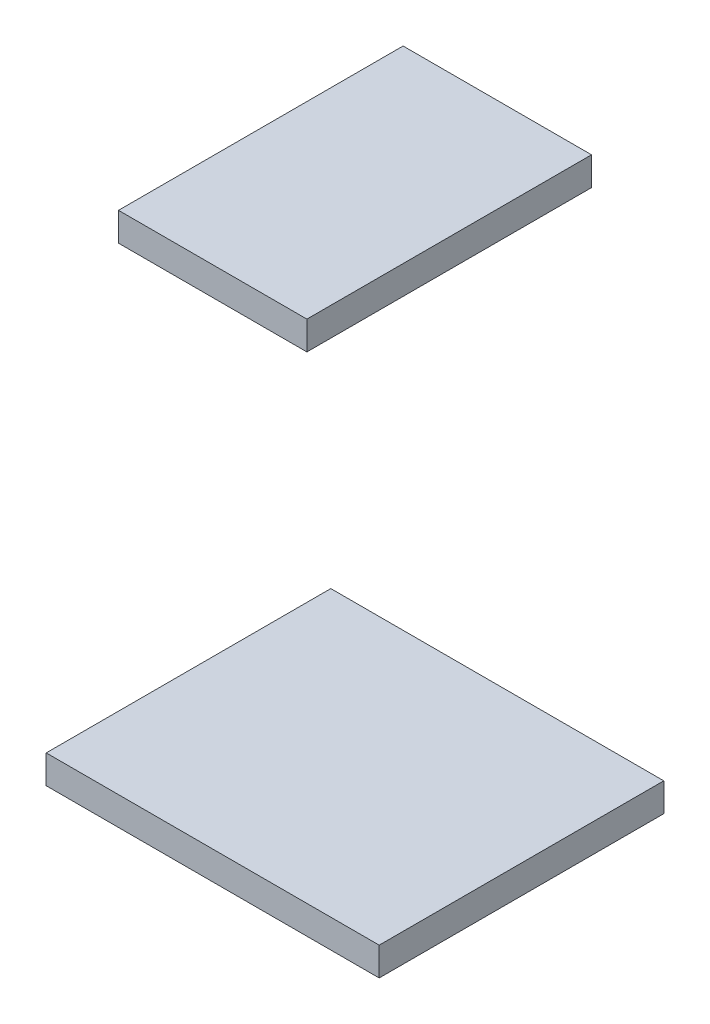
ISO-10303-21;
HEADER;
FILE_DESCRIPTION(('STEP AP214'),'2;1');
FILE_NAME('part.step','',(''),(''),'','','');
FILE_SCHEMA(('AUTOMOTIVE_DESIGN { 1 0 10303 214 1 1 1 1 }'));
ENDSEC;
DATA;
#1=APPLICATION_CONTEXT('core data for automotive mechanical design processes');
#2=APPLICATION_PROTOCOL_DEFINITION('international standard','automotive_design',2000,#1);
#3=PRODUCT_CONTEXT('',#1,'mechanical');
#4=PRODUCT('Part','Part','',(#3));
#5=PRODUCT_RELATED_PRODUCT_CATEGORY('part','',(#4));
#6=PRODUCT_DEFINITION_FORMATION('','',#4);
#7=PRODUCT_DEFINITION_CONTEXT('part definition',#1,'design');
#8=PRODUCT_DEFINITION('design','',#6,#7);
#9=PRODUCT_DEFINITION_SHAPE('','',#8);
#10=(LENGTH_UNIT() NAMED_UNIT(*) SI_UNIT(.MILLI.,.METRE.));
#11=(NAMED_UNIT(*) PLANE_ANGLE_UNIT() SI_UNIT($,.RADIAN.));
#12=(NAMED_UNIT(*) SI_UNIT($,.STERADIAN.) SOLID_ANGLE_UNIT());
#13=UNCERTAINTY_MEASURE_WITH_UNIT(LENGTH_MEASURE(1.E-05),#10,'distance_accuracy_value','');
#14=(GEOMETRIC_REPRESENTATION_CONTEXT(3) GLOBAL_UNCERTAINTY_ASSIGNED_CONTEXT((#13)) GLOBAL_UNIT_ASSIGNED_CONTEXT((#10,
#11,#12)) REPRESENTATION_CONTEXT('',''));
#15=CARTESIAN_POINT('',(0.,0.,0.));
#16=DIRECTION('',(0.,0.,1.));
#17=DIRECTION('',(1.,0.,0.));
#18=AXIS2_PLACEMENT_3D('',#15,#16,#17);
#19=CARTESIAN_POINT('',(99.655,-17.41,10.));
#20=DIRECTION('',(-1.,0.,0.));
#21=DIRECTION('',(0.,0.,1.));
#22=AXIS2_PLACEMENT_3D('',#19,#20,#21);
#23=PLANE('',#22);
#24=DIRECTION('',(0.,1.,0.));
#25=VECTOR('',#24,1.);
#26=CARTESIAN_POINT('',(99.655,-17.41,0.));
#27=LINE('',#26,#25);
#28=CARTESIAN_POINT('',(99.655,-18.41,0.));
#29=VERTEX_POINT('',#28);
#30=CARTESIAN_POINT('',(99.655,-17.41,0.));
#31=VERTEX_POINT('',#30);
#32=EDGE_CURVE('E12',#29,#31,#27,.T.);
#33=ORIENTED_EDGE('',*,*,#32,.T.);
#34=DIRECTION('',(0.,0.,-1.));
#35=VECTOR('',#34,1.);
#36=CARTESIAN_POINT('',(99.655,-17.41,10.));
#37=LINE('',#36,#35);
#38=CARTESIAN_POINT('',(99.655,-17.41,10.));
#39=VERTEX_POINT('',#38);
#40=EDGE_CURVE('E118',#39,#31,#37,.T.);
#41=ORIENTED_EDGE('',*,*,#40,.F.);
#42=DIRECTION('',(0.,1.,0.));
#43=VECTOR('',#42,1.);
#44=CARTESIAN_POINT('',(99.655,-17.41,10.));
#45=LINE('',#44,#43);
#46=CARTESIAN_POINT('',(99.655,-18.41,10.));
#47=VERTEX_POINT('',#46);
#48=EDGE_CURVE('E51',#47,#39,#45,.T.);
#49=ORIENTED_EDGE('',*,*,#48,.F.);
#50=DIRECTION('',(0.,0.,-1.));
#51=VECTOR('',#50,1.);
#52=CARTESIAN_POINT('',(99.655,-18.41,10.));
#53=LINE('',#52,#51);
#54=EDGE_CURVE('E106',#47,#29,#53,.T.);
#55=ORIENTED_EDGE('',*,*,#54,.T.);
#56=EDGE_LOOP('',(#33,#41,#49,#55));
#57=FACE_BOUND('',#56,.T.);
#58=ADVANCED_FACE('F47',(#57),#23,.F.);
#59=CARTESIAN_POINT('',(99.655,-17.41,10.));
#60=DIRECTION('',(0.,-1.,0.));
#61=DIRECTION('',(0.,0.,-1.));
#62=AXIS2_PLACEMENT_3D('',#59,#60,#61);
#63=PLANE('',#62);
#64=DIRECTION('',(-1.,0.,0.));
#65=VECTOR('',#64,1.);
#66=CARTESIAN_POINT('',(99.655,-17.41,0.));
#67=LINE('',#66,#65);
#68=CARTESIAN_POINT('',(93.035,-17.41,0.));
#69=VERTEX_POINT('',#68);
#70=EDGE_CURVE('E57',#31,#69,#67,.T.);
#71=ORIENTED_EDGE('',*,*,#70,.T.);
#72=DIRECTION('',(0.,0.,-1.));
#73=VECTOR('',#72,1.);
#74=CARTESIAN_POINT('',(93.035,-17.41,10.));
#75=LINE('',#74,#73);
#76=CARTESIAN_POINT('',(93.035,-17.41,10.));
#77=VERTEX_POINT('',#76);
#78=EDGE_CURVE('E102',#77,#69,#75,.T.);
#79=ORIENTED_EDGE('',*,*,#78,.F.);
#80=DIRECTION('',(-1.,0.,0.));
#81=VECTOR('',#80,1.);
#82=CARTESIAN_POINT('',(99.655,-17.41,10.));
#83=LINE('',#82,#81);
#84=EDGE_CURVE('E81',#39,#77,#83,.T.);
#85=ORIENTED_EDGE('',*,*,#84,.F.);
#86=ORIENTED_EDGE('',*,*,#40,.T.);
#87=EDGE_LOOP('',(#71,#79,#85,#86));
#88=FACE_BOUND('',#87,.T.);
#89=ADVANCED_FACE('F121',(#88),#63,.F.);
#90=CARTESIAN_POINT('',(93.035,-17.41,10.));
#91=DIRECTION('',(1.,0.,0.));
#92=DIRECTION('',(0.,0.,-1.));
#93=AXIS2_PLACEMENT_3D('',#90,#91,#92);
#94=PLANE('',#93);
#95=DIRECTION('',(0.,-1.,0.));
#96=VECTOR('',#95,1.);
#97=CARTESIAN_POINT('',(93.035,-17.41,0.));
#98=LINE('',#97,#96);
#99=CARTESIAN_POINT('',(93.035,-18.41,0.));
#100=VERTEX_POINT('',#99);
#101=EDGE_CURVE('E97',#69,#100,#98,.T.);
#102=ORIENTED_EDGE('',*,*,#101,.T.);
#103=DIRECTION('',(0.,0.,-1.));
#104=VECTOR('',#103,1.);
#105=CARTESIAN_POINT('',(93.035,-18.41,10.));
#106=LINE('',#105,#104);
#107=CARTESIAN_POINT('',(93.035,-18.41,10.));
#108=VERTEX_POINT('',#107);
#109=EDGE_CURVE('E100',#108,#100,#106,.T.);
#110=ORIENTED_EDGE('',*,*,#109,.F.);
#111=DIRECTION('',(0.,-1.,0.));
#112=VECTOR('',#111,1.);
#113=CARTESIAN_POINT('',(93.035,-17.41,10.));
#114=LINE('',#113,#112);
#115=EDGE_CURVE('E114',#77,#108,#114,.T.);
#116=ORIENTED_EDGE('',*,*,#115,.F.);
#117=ORIENTED_EDGE('',*,*,#78,.T.);
#118=EDGE_LOOP('',(#102,#110,#116,#117));
#119=FACE_BOUND('',#118,.T.);
#120=ADVANCED_FACE('F98',(#119),#94,.F.);
#121=CARTESIAN_POINT('',(99.655,-18.41,10.));
#122=DIRECTION('',(0.,1.,0.));
#123=DIRECTION('',(0.,0.,1.));
#124=AXIS2_PLACEMENT_3D('',#121,#122,#123);
#125=PLANE('',#124);
#126=DIRECTION('',(1.,0.,0.));
#127=VECTOR('',#126,1.);
#128=CARTESIAN_POINT('',(99.655,-18.41,0.));
#129=LINE('',#128,#127);
#130=EDGE_CURVE('E91',#100,#29,#129,.T.);
#131=ORIENTED_EDGE('',*,*,#130,.T.);
#132=ORIENTED_EDGE('',*,*,#54,.F.);
#133=DIRECTION('',(1.,0.,0.));
#134=VECTOR('',#133,1.);
#135=CARTESIAN_POINT('',(99.655,-18.41,10.));
#136=LINE('',#135,#134);
#137=EDGE_CURVE('E105',#108,#47,#136,.T.);
#138=ORIENTED_EDGE('',*,*,#137,.F.);
#139=ORIENTED_EDGE('',*,*,#109,.T.);
#140=EDGE_LOOP('',(#131,#132,#138,#139));
#141=FACE_BOUND('',#140,.T.);
#142=ADVANCED_FACE('F104',(#141),#125,.F.);
#143=CARTESIAN_POINT('',(0.,0.,10.));
#144=DIRECTION('',(0.,0.,-1.));
#145=DIRECTION('',(-1.,0.,0.));
#146=AXIS2_PLACEMENT_3D('',#143,#144,#145);
#147=PLANE('',#146);
#148=ORIENTED_EDGE('',*,*,#48,.T.);
#149=ORIENTED_EDGE('',*,*,#84,.T.);
#150=ORIENTED_EDGE('',*,*,#115,.T.);
#151=ORIENTED_EDGE('',*,*,#137,.T.);
#152=EDGE_LOOP('',(#148,#149,#150,#151));
#153=FACE_BOUND('',#152,.T.);
#154=ADVANCED_FACE('F49',(#153),#147,.F.);
#155=CARTESIAN_POINT('',(0.,0.,0.));
#156=DIRECTION('',(0.,0.,-1.));
#157=DIRECTION('',(-1.,0.,0.));
#158=AXIS2_PLACEMENT_3D('',#155,#156,#157);
#159=PLANE('',#158);
#160=ORIENTED_EDGE('',*,*,#32,.F.);
#161=ORIENTED_EDGE('',*,*,#130,.F.);
#162=ORIENTED_EDGE('',*,*,#101,.F.);
#163=ORIENTED_EDGE('',*,*,#70,.F.);
#164=EDGE_LOOP('',(#160,#161,#162,#163));
#165=FACE_BOUND('',#164,.T.);
#166=ADVANCED_FACE('F108',(#165),#159,.T.);
#167=CLOSED_SHELL('',(#58,#89,#120,#142,#154,#166));
#168=MANIFOLD_SOLID_BREP('B2',#167);
#169=CARTESIAN_POINT('',(102.195,-35.19,10.));
#170=DIRECTION('',(-1.,0.,0.));
#171=DIRECTION('',(0.,0.,1.));
#172=AXIS2_PLACEMENT_3D('',#169,#170,#171);
#173=PLANE('',#172);
#174=DIRECTION('',(0.,1.,0.));
#175=VECTOR('',#174,1.);
#176=CARTESIAN_POINT('',(102.195,-35.19,0.));
#177=LINE('',#176,#175);
#178=CARTESIAN_POINT('',(102.195,-36.19,0.));
#179=VERTEX_POINT('',#178);
#180=CARTESIAN_POINT('',(102.195,-35.19,0.));
#181=VERTEX_POINT('',#180);
#182=EDGE_CURVE('E246',#179,#181,#177,.T.);
#183=ORIENTED_EDGE('',*,*,#182,.T.);
#184=DIRECTION('',(0.,0.,-1.));
#185=VECTOR('',#184,1.);
#186=CARTESIAN_POINT('',(102.195,-35.19,10.));
#187=LINE('',#186,#185);
#188=CARTESIAN_POINT('',(102.195,-35.19,10.));
#189=VERTEX_POINT('',#188);
#190=EDGE_CURVE('E45',#189,#181,#187,.T.);
#191=ORIENTED_EDGE('',*,*,#190,.F.);
#192=DIRECTION('',(0.,1.,0.));
#193=VECTOR('',#192,1.);
#194=CARTESIAN_POINT('',(102.195,-35.19,10.));
#195=LINE('',#194,#193);
#196=CARTESIAN_POINT('',(102.195,-36.19,10.));
#197=VERTEX_POINT('',#196);
#198=EDGE_CURVE('E234',#197,#189,#195,.T.);
#199=ORIENTED_EDGE('',*,*,#198,.F.);
#200=DIRECTION('',(0.,0.,-1.));
#201=VECTOR('',#200,1.);
#202=CARTESIAN_POINT('',(102.195,-36.19,10.));
#203=LINE('',#202,#201);
#204=EDGE_CURVE('E242',#197,#179,#203,.T.);
#205=ORIENTED_EDGE('',*,*,#204,.T.);
#206=EDGE_LOOP('',(#183,#191,#199,#205));
#207=FACE_BOUND('',#206,.T.);
#208=ADVANCED_FACE('F183',(#207),#173,.F.);
#209=CARTESIAN_POINT('',(102.195,-35.19,10.));
#210=DIRECTION('',(0.,-1.,0.));
#211=DIRECTION('',(0.,0.,-1.));
#212=AXIS2_PLACEMENT_3D('',#209,#210,#211);
#213=PLANE('',#212);
#214=DIRECTION('',(-1.,0.,0.));
#215=VECTOR('',#214,1.);
#216=CARTESIAN_POINT('',(102.195,-35.19,0.));
#217=LINE('',#216,#215);
#218=CARTESIAN_POINT('',(90.495,-35.19,0.));
#219=VERTEX_POINT('',#218);
#220=EDGE_CURVE('E238',#181,#219,#217,.T.);
#221=ORIENTED_EDGE('',*,*,#220,.T.);
#222=DIRECTION('',(0.,0.,-1.));
#223=VECTOR('',#222,1.);
#224=CARTESIAN_POINT('',(90.495,-35.19,10.));
#225=LINE('',#224,#223);
#226=CARTESIAN_POINT('',(90.495,-35.19,10.));
#227=VERTEX_POINT('',#226);
#228=EDGE_CURVE('E191',#227,#219,#225,.T.);
#229=ORIENTED_EDGE('',*,*,#228,.F.);
#230=DIRECTION('',(-1.,0.,0.));
#231=VECTOR('',#230,1.);
#232=CARTESIAN_POINT('',(102.195,-35.19,10.));
#233=LINE('',#232,#231);
#234=EDGE_CURVE('E229',#189,#227,#233,.T.);
#235=ORIENTED_EDGE('',*,*,#234,.F.);
#236=ORIENTED_EDGE('',*,*,#190,.T.);
#237=EDGE_LOOP('',(#221,#229,#235,#236));
#238=FACE_BOUND('',#237,.T.);
#239=ADVANCED_FACE('F237',(#238),#213,.F.);
#240=CARTESIAN_POINT('',(90.495,-35.19,10.));
#241=DIRECTION('',(1.,0.,0.));
#242=DIRECTION('',(0.,0.,-1.));
#243=AXIS2_PLACEMENT_3D('',#240,#241,#242);
#244=PLANE('',#243);
#245=DIRECTION('',(0.,-1.,0.));
#246=VECTOR('',#245,1.);
#247=CARTESIAN_POINT('',(90.495,-35.19,0.));
#248=LINE('',#247,#246);
#249=CARTESIAN_POINT('',(90.495,-36.19,0.));
#250=VERTEX_POINT('',#249);
#251=EDGE_CURVE('E216',#219,#250,#248,.T.);
#252=ORIENTED_EDGE('',*,*,#251,.T.);
#253=DIRECTION('',(0.,0.,-1.));
#254=VECTOR('',#253,1.);
#255=CARTESIAN_POINT('',(90.495,-36.19,10.));
#256=LINE('',#255,#254);
#257=CARTESIAN_POINT('',(90.495,-36.19,10.));
#258=VERTEX_POINT('',#257);
#259=EDGE_CURVE('E239',#258,#250,#256,.T.);
#260=ORIENTED_EDGE('',*,*,#259,.F.);
#261=DIRECTION('',(0.,-1.,0.));
#262=VECTOR('',#261,1.);
#263=CARTESIAN_POINT('',(90.495,-35.19,10.));
#264=LINE('',#263,#262);
#265=EDGE_CURVE('E232',#227,#258,#264,.T.);
#266=ORIENTED_EDGE('',*,*,#265,.F.);
#267=ORIENTED_EDGE('',*,*,#228,.T.);
#268=EDGE_LOOP('',(#252,#260,#266,#267));
#269=FACE_BOUND('',#268,.T.);
#270=ADVANCED_FACE('F240',(#269),#244,.F.);
#271=CARTESIAN_POINT('',(102.195,-36.19,10.));
#272=DIRECTION('',(0.,1.,0.));
#273=DIRECTION('',(0.,0.,1.));
#274=AXIS2_PLACEMENT_3D('',#271,#272,#273);
#275=PLANE('',#274);
#276=DIRECTION('',(1.,0.,0.));
#277=VECTOR('',#276,1.);
#278=CARTESIAN_POINT('',(102.195,-36.19,0.));
#279=LINE('',#278,#277);
#280=EDGE_CURVE('E222',#250,#179,#279,.T.);
#281=ORIENTED_EDGE('',*,*,#280,.T.);
#282=ORIENTED_EDGE('',*,*,#204,.F.);
#283=DIRECTION('',(1.,0.,0.));
#284=VECTOR('',#283,1.);
#285=CARTESIAN_POINT('',(102.195,-36.19,10.));
#286=LINE('',#285,#284);
#287=EDGE_CURVE('E199',#258,#197,#286,.T.);
#288=ORIENTED_EDGE('',*,*,#287,.F.);
#289=ORIENTED_EDGE('',*,*,#259,.T.);
#290=EDGE_LOOP('',(#281,#282,#288,#289));
#291=FACE_BOUND('',#290,.T.);
#292=ADVANCED_FACE('F253',(#291),#275,.F.);
#293=CARTESIAN_POINT('',(0.,0.,10.));
#294=DIRECTION('',(0.,0.,-1.));
#295=DIRECTION('',(-1.,0.,0.));
#296=AXIS2_PLACEMENT_3D('',#293,#294,#295);
#297=PLANE('',#296);
#298=ORIENTED_EDGE('',*,*,#198,.T.);
#299=ORIENTED_EDGE('',*,*,#234,.T.);
#300=ORIENTED_EDGE('',*,*,#265,.T.);
#301=ORIENTED_EDGE('',*,*,#287,.T.);
#302=EDGE_LOOP('',(#298,#299,#300,#301));
#303=FACE_BOUND('',#302,.T.);
#304=ADVANCED_FACE('F230',(#303),#297,.F.);
#305=CARTESIAN_POINT('',(0.,0.,0.));
#306=DIRECTION('',(0.,0.,-1.));
#307=DIRECTION('',(-1.,0.,0.));
#308=AXIS2_PLACEMENT_3D('',#305,#306,#307);
#309=PLANE('',#308);
#310=ORIENTED_EDGE('',*,*,#182,.F.);
#311=ORIENTED_EDGE('',*,*,#280,.F.);
#312=ORIENTED_EDGE('',*,*,#251,.F.);
#313=ORIENTED_EDGE('',*,*,#220,.F.);
#314=EDGE_LOOP('',(#310,#311,#312,#313));
#315=FACE_BOUND('',#314,.T.);
#316=ADVANCED_FACE('F256',(#315),#309,.T.);
#317=CLOSED_SHELL('',(#208,#239,#270,#292,#304,#316));
#318=MANIFOLD_SOLID_BREP('B6',#317);
#319=ADVANCED_BREP_SHAPE_REPRESENTATION('',(#18,#168,#318),#14);
#320=SHAPE_DEFINITION_REPRESENTATION(#9,#319);
ENDSEC;
END-ISO-10303-21;
